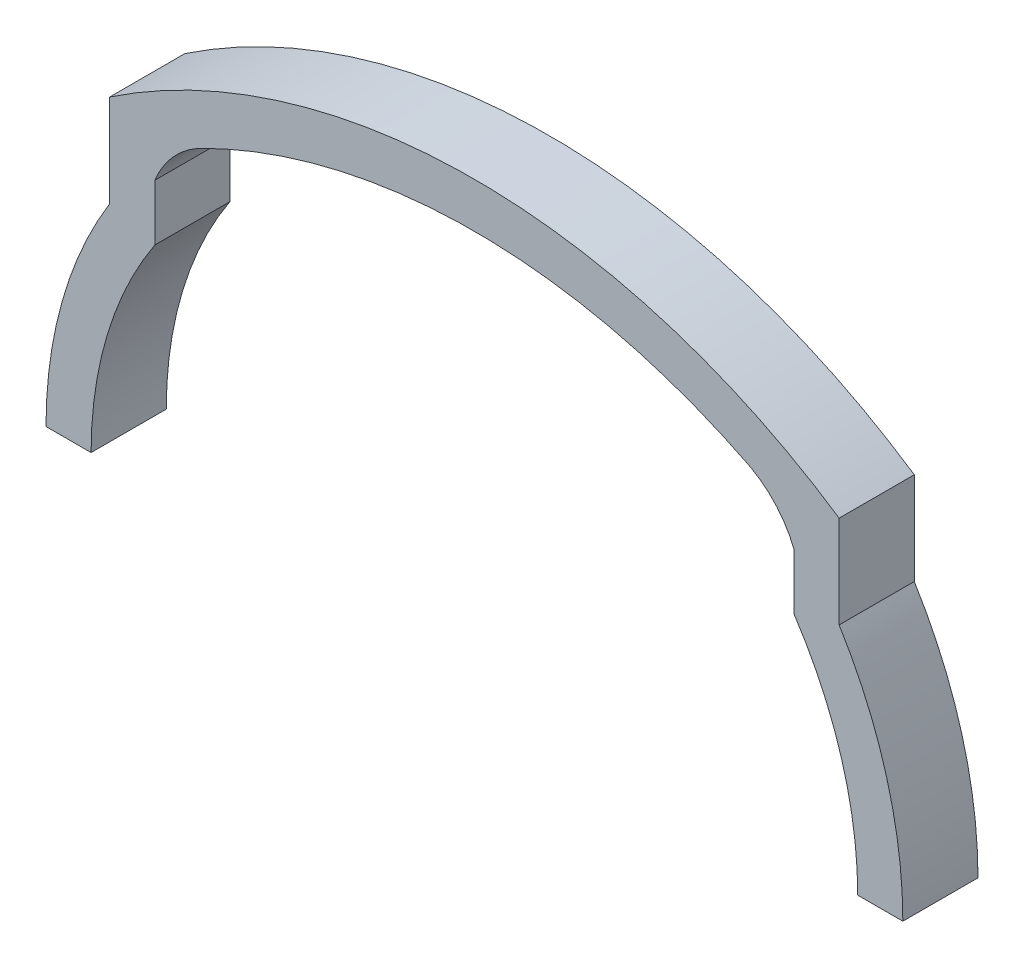
ISO-10303-21;
HEADER;
FILE_DESCRIPTION(('STEP AP214'),'2;1');
FILE_NAME('part.step','',(''),(''),'','','');
FILE_SCHEMA(('AUTOMOTIVE_DESIGN { 1 0 10303 214 1 1 1 1 }'));
ENDSEC;
DATA;
#1=APPLICATION_CONTEXT('core data for automotive mechanical design processes');
#2=APPLICATION_PROTOCOL_DEFINITION('international standard','automotive_design',2000,#1);
#3=PRODUCT_CONTEXT('',#1,'mechanical');
#4=PRODUCT('Part','Part','',(#3));
#5=PRODUCT_RELATED_PRODUCT_CATEGORY('part','',(#4));
#6=PRODUCT_DEFINITION_FORMATION('','',#4);
#7=PRODUCT_DEFINITION_CONTEXT('part definition',#1,'design');
#8=PRODUCT_DEFINITION('design','',#6,#7);
#9=PRODUCT_DEFINITION_SHAPE('','',#8);
#10=(LENGTH_UNIT() NAMED_UNIT(*) SI_UNIT(.MILLI.,.METRE.));
#11=(NAMED_UNIT(*) PLANE_ANGLE_UNIT() SI_UNIT($,.RADIAN.));
#12=(NAMED_UNIT(*) SI_UNIT($,.STERADIAN.) SOLID_ANGLE_UNIT());
#13=UNCERTAINTY_MEASURE_WITH_UNIT(LENGTH_MEASURE(1.E-05),#10,'distance_accuracy_value','');
#14=(GEOMETRIC_REPRESENTATION_CONTEXT(3) GLOBAL_UNCERTAINTY_ASSIGNED_CONTEXT((#13)) GLOBAL_UNIT_ASSIGNED_CONTEXT((#10,
#11,#12)) REPRESENTATION_CONTEXT('',''));
#15=CARTESIAN_POINT('',(0.,0.,0.));
#16=DIRECTION('',(0.,0.,1.));
#17=DIRECTION('',(1.,0.,0.));
#18=AXIS2_PLACEMENT_3D('',#15,#16,#17);
#19=CARTESIAN_POINT('',(15.2226606063706,15.4082945347792,5.));
#20=DIRECTION('',(0.,0.,-1.));
#21=DIRECTION('',(-1.,0.,0.));
#22=AXIS2_PLACEMENT_3D('',#19,#20,#21);
#23=CYLINDRICAL_SURFACE('',#22,6.49856152460727);
#24=CARTESIAN_POINT('',(15.2226606063706,15.4082945347792,0.));
#25=DIRECTION('',(0.,0.,1.));
#26=DIRECTION('',(1.,0.,0.));
#27=AXIS2_PLACEMENT_3D('',#24,#25,#26);
#28=CIRCLE('',#27,6.49856152460727);
#29=CARTESIAN_POINT('',(21.2625,17.8065526502179,0.));
#30=VERTEX_POINT('',#29);
#31=CARTESIAN_POINT('',(18.3614611419998,21.0985698432892,0.));
#32=VERTEX_POINT('',#31);
#33=EDGE_CURVE('E178',#30,#32,#28,.T.);
#34=ORIENTED_EDGE('',*,*,#33,.F.);
#35=DIRECTION('',(0.,0.,-1.));
#36=VECTOR('',#35,1.);
#37=CARTESIAN_POINT('',(21.2625,17.8065526502179,5.));
#38=LINE('',#37,#36);
#39=CARTESIAN_POINT('',(21.2625,17.8065526502179,5.));
#40=VERTEX_POINT('',#39);
#41=EDGE_CURVE('E11',#40,#30,#38,.T.);
#42=ORIENTED_EDGE('',*,*,#41,.F.);
#43=CARTESIAN_POINT('',(15.2226606063706,15.4082945347792,5.));
#44=DIRECTION('',(0.,0.,1.));
#45=DIRECTION('',(1.,0.,0.));
#46=AXIS2_PLACEMENT_3D('',#43,#44,#45);
#47=CIRCLE('',#46,6.49856152460727);
#48=CARTESIAN_POINT('',(18.3614611419998,21.0985698432892,5.));
#49=VERTEX_POINT('',#48);
#50=EDGE_CURVE('E223',#40,#49,#47,.T.);
#51=ORIENTED_EDGE('',*,*,#50,.T.);
#52=DIRECTION('',(0.,0.,-1.));
#53=VECTOR('',#52,1.);
#54=CARTESIAN_POINT('',(18.3614611419998,21.0985698432892,5.));
#55=LINE('',#54,#53);
#56=EDGE_CURVE('E58',#49,#32,#55,.T.);
#57=ORIENTED_EDGE('',*,*,#56,.T.);
#58=EDGE_LOOP('',(#34,#42,#51,#57));
#59=FACE_BOUND('',#58,.T.);
#60=ADVANCED_FACE('F41',(#59),#23,.F.);
#61=CARTESIAN_POINT('',(21.2625,0.,5.));
#62=DIRECTION('',(1.,0.,0.));
#63=DIRECTION('',(0.,1.,0.));
#64=AXIS2_PLACEMENT_3D('',#61,#62,#63);
#65=PLANE('',#64);
#66=DIRECTION('',(0.,-1.,0.));
#67=VECTOR('',#66,1.);
#68=CARTESIAN_POINT('',(21.2625,0.,0.));
#69=LINE('',#68,#67);
#70=CARTESIAN_POINT('',(21.2625,14.0767927366286,0.));
#71=VERTEX_POINT('',#70);
#72=EDGE_CURVE('E181',#30,#71,#69,.T.);
#73=ORIENTED_EDGE('',*,*,#72,.T.);
#74=DIRECTION('',(0.,0.,-1.));
#75=VECTOR('',#74,1.);
#76=CARTESIAN_POINT('',(21.2625,14.0767927366286,5.));
#77=LINE('',#76,#75);
#78=CARTESIAN_POINT('',(21.2625,14.0767927366286,5.));
#79=VERTEX_POINT('',#78);
#80=EDGE_CURVE('E50',#79,#71,#77,.T.);
#81=ORIENTED_EDGE('',*,*,#80,.F.);
#82=DIRECTION('',(0.,-1.,0.));
#83=VECTOR('',#82,1.);
#84=CARTESIAN_POINT('',(21.2625,0.,5.));
#85=LINE('',#84,#83);
#86=EDGE_CURVE('E452',#40,#79,#85,.T.);
#87=ORIENTED_EDGE('',*,*,#86,.F.);
#88=ORIENTED_EDGE('',*,*,#41,.T.);
#89=EDGE_LOOP('',(#73,#81,#87,#88));
#90=FACE_BOUND('',#89,.T.);
#91=ADVANCED_FACE('F267',(#90),#65,.F.);
#92=CARTESIAN_POINT('',(0.,0.,5.));
#93=DIRECTION('',(0.,0.,-1.));
#94=DIRECTION('',(-1.,0.,0.));
#95=AXIS2_PLACEMENT_3D('',#92,#93,#94);
#96=CYLINDRICAL_SURFACE('',#95,25.5);
#97=CARTESIAN_POINT('',(0.,0.,0.));
#98=DIRECTION('',(0.,0.,1.));
#99=DIRECTION('',(1.,0.,0.));
#100=AXIS2_PLACEMENT_3D('',#97,#98,#99);
#101=CIRCLE('',#100,25.5);
#102=CARTESIAN_POINT('',(25.5,0.,0.));
#103=VERTEX_POINT('',#102);
#104=EDGE_CURVE('E185',#103,#71,#101,.T.);
#105=ORIENTED_EDGE('',*,*,#104,.F.);
#106=DIRECTION('',(0.,0.,-1.));
#107=VECTOR('',#106,1.);
#108=CARTESIAN_POINT('',(25.5,0.,5.));
#109=LINE('',#108,#107);
#110=CARTESIAN_POINT('',(25.5,0.,5.));
#111=VERTEX_POINT('',#110);
#112=EDGE_CURVE('E255',#111,#103,#109,.T.);
#113=ORIENTED_EDGE('',*,*,#112,.F.);
#114=CARTESIAN_POINT('',(0.,0.,5.));
#115=DIRECTION('',(0.,0.,1.));
#116=DIRECTION('',(1.,0.,0.));
#117=AXIS2_PLACEMENT_3D('',#114,#115,#116);
#118=CIRCLE('',#117,25.5);
#119=EDGE_CURVE('E264',#111,#79,#118,.T.);
#120=ORIENTED_EDGE('',*,*,#119,.T.);
#121=ORIENTED_EDGE('',*,*,#80,.T.);
#122=EDGE_LOOP('',(#105,#113,#120,#121));
#123=FACE_BOUND('',#122,.T.);
#124=ADVANCED_FACE('F262',(#123),#96,.F.);
#125=CARTESIAN_POINT('',(0.,0.,5.));
#126=DIRECTION('',(0.,1.,0.));
#127=DIRECTION('',(0.,0.,1.));
#128=AXIS2_PLACEMENT_3D('',#125,#126,#127);
#129=PLANE('',#128);
#130=DIRECTION('',(1.,0.,0.));
#131=VECTOR('',#130,1.);
#132=CARTESIAN_POINT('',(0.,0.,0.));
#133=LINE('',#132,#131);
#134=CARTESIAN_POINT('',(28.5,0.,0.));
#135=VERTEX_POINT('',#134);
#136=EDGE_CURVE('E189',#103,#135,#133,.T.);
#137=ORIENTED_EDGE('',*,*,#136,.T.);
#138=DIRECTION('',(0.,0.,-1.));
#139=VECTOR('',#138,1.);
#140=CARTESIAN_POINT('',(28.5,0.,5.));
#141=LINE('',#140,#139);
#142=CARTESIAN_POINT('',(28.5,0.,5.));
#143=VERTEX_POINT('',#142);
#144=EDGE_CURVE('E251',#143,#135,#141,.T.);
#145=ORIENTED_EDGE('',*,*,#144,.F.);
#146=DIRECTION('',(1.,0.,0.));
#147=VECTOR('',#146,1.);
#148=CARTESIAN_POINT('',(0.,0.,5.));
#149=LINE('',#148,#147);
#150=EDGE_CURVE('E285',#111,#143,#149,.T.);
#151=ORIENTED_EDGE('',*,*,#150,.F.);
#152=ORIENTED_EDGE('',*,*,#112,.T.);
#153=EDGE_LOOP('',(#137,#145,#151,#152));
#154=FACE_BOUND('',#153,.T.);
#155=ADVANCED_FACE('F274',(#154),#129,.F.);
#156=CARTESIAN_POINT('',(0.,0.,5.));
#157=DIRECTION('',(0.,0.,-1.));
#158=DIRECTION('',(-1.,0.,0.));
#159=AXIS2_PLACEMENT_3D('',#156,#157,#158);
#160=CYLINDRICAL_SURFACE('',#159,28.5);
#161=CARTESIAN_POINT('',(0.,0.,0.));
#162=DIRECTION('',(0.,0.,1.));
#163=DIRECTION('',(1.,0.,0.));
#164=AXIS2_PLACEMENT_3D('',#161,#162,#163);
#165=CIRCLE('',#164,28.5);
#166=CARTESIAN_POINT('',(24.2625,14.9526283224723,0.));
#167=VERTEX_POINT('',#166);
#168=EDGE_CURVE('E192',#135,#167,#165,.T.);
#169=ORIENTED_EDGE('',*,*,#168,.T.);
#170=DIRECTION('',(0.,0.,-1.));
#171=VECTOR('',#170,1.);
#172=CARTESIAN_POINT('',(24.2625,14.9526283224723,5.));
#173=LINE('',#172,#171);
#174=CARTESIAN_POINT('',(24.2625,14.9526283224723,5.));
#175=VERTEX_POINT('',#174);
#176=EDGE_CURVE('E248',#175,#167,#173,.T.);
#177=ORIENTED_EDGE('',*,*,#176,.F.);
#178=CARTESIAN_POINT('',(0.,0.,5.));
#179=DIRECTION('',(0.,0.,1.));
#180=DIRECTION('',(1.,0.,0.));
#181=AXIS2_PLACEMENT_3D('',#178,#179,#180);
#182=CIRCLE('',#181,28.5);
#183=EDGE_CURVE('E280',#143,#175,#182,.T.);
#184=ORIENTED_EDGE('',*,*,#183,.F.);
#185=ORIENTED_EDGE('',*,*,#144,.T.);
#186=EDGE_LOOP('',(#169,#177,#184,#185));
#187=FACE_BOUND('',#186,.T.);
#188=ADVANCED_FACE('F278',(#187),#160,.T.);
#189=CARTESIAN_POINT('',(24.2625,0.,5.));
#190=DIRECTION('',(1.,0.,0.));
#191=DIRECTION('',(0.,0.,-1.));
#192=AXIS2_PLACEMENT_3D('',#189,#190,#191);
#193=PLANE('',#192);
#194=DIRECTION('',(0.,-1.,0.));
#195=VECTOR('',#194,1.);
#196=CARTESIAN_POINT('',(24.2625,0.,0.));
#197=LINE('',#196,#195);
#198=CARTESIAN_POINT('',(24.2625,21.1051394367893,0.));
#199=VERTEX_POINT('',#198);
#200=EDGE_CURVE('E197',#199,#167,#197,.T.);
#201=ORIENTED_EDGE('',*,*,#200,.F.);
#202=DIRECTION('',(0.,0.,-1.));
#203=VECTOR('',#202,1.);
#204=CARTESIAN_POINT('',(24.2625,21.1051394367893,5.));
#205=LINE('',#204,#203);
#206=CARTESIAN_POINT('',(24.2625,21.1051394367893,5.));
#207=VERTEX_POINT('',#206);
#208=EDGE_CURVE('E245',#207,#199,#205,.T.);
#209=ORIENTED_EDGE('',*,*,#208,.F.);
#210=DIRECTION('',(0.,-1.,0.));
#211=VECTOR('',#210,1.);
#212=CARTESIAN_POINT('',(24.2625,0.,5.));
#213=LINE('',#212,#211);
#214=EDGE_CURVE('E284',#207,#175,#213,.T.);
#215=ORIENTED_EDGE('',*,*,#214,.T.);
#216=ORIENTED_EDGE('',*,*,#176,.T.);
#217=EDGE_LOOP('',(#201,#209,#215,#216));
#218=FACE_BOUND('',#217,.T.);
#219=ADVANCED_FACE('F333',(#218),#193,.T.);
#220=CARTESIAN_POINT('',(0.,-15.,5.));
#221=DIRECTION('',(0.,0.,-1.));
#222=DIRECTION('',(-1.,0.,0.));
#223=AXIS2_PLACEMENT_3D('',#220,#221,#222);
#224=CYLINDRICAL_SURFACE('',#223,43.5);
#225=CARTESIAN_POINT('',(0.,-15.,0.));
#226=DIRECTION('',(0.,0.,1.));
#227=DIRECTION('',(1.,0.,0.));
#228=AXIS2_PLACEMENT_3D('',#225,#226,#227);
#229=CIRCLE('',#228,43.5);
#230=CARTESIAN_POINT('',(-24.2625,21.1051394367893,0.));
#231=VERTEX_POINT('',#230);
#232=EDGE_CURVE('E201',#199,#231,#229,.T.);
#233=ORIENTED_EDGE('',*,*,#232,.T.);
#234=DIRECTION('',(0.,0.,-1.));
#235=VECTOR('',#234,1.);
#236=CARTESIAN_POINT('',(-24.2625,21.1051394367893,5.));
#237=LINE('',#236,#235);
#238=CARTESIAN_POINT('',(-24.2625,21.1051394367893,5.));
#239=VERTEX_POINT('',#238);
#240=EDGE_CURVE('E241',#239,#231,#237,.T.);
#241=ORIENTED_EDGE('',*,*,#240,.F.);
#242=CARTESIAN_POINT('',(0.,-15.,5.));
#243=DIRECTION('',(0.,0.,1.));
#244=DIRECTION('',(1.,0.,0.));
#245=AXIS2_PLACEMENT_3D('',#242,#243,#244);
#246=CIRCLE('',#245,43.5);
#247=EDGE_CURVE('E289',#207,#239,#246,.T.);
#248=ORIENTED_EDGE('',*,*,#247,.F.);
#249=ORIENTED_EDGE('',*,*,#208,.T.);
#250=EDGE_LOOP('',(#233,#241,#248,#249));
#251=FACE_BOUND('',#250,.T.);
#252=ADVANCED_FACE('F336',(#251),#224,.T.);
#253=CARTESIAN_POINT('',(-24.2625,0.,5.));
#254=DIRECTION('',(1.,0.,0.));
#255=DIRECTION('',(0.,0.,-1.));
#256=AXIS2_PLACEMENT_3D('',#253,#254,#255);
#257=PLANE('',#256);
#258=DIRECTION('',(0.,-1.,0.));
#259=VECTOR('',#258,1.);
#260=CARTESIAN_POINT('',(-24.2625,0.,0.));
#261=LINE('',#260,#259);
#262=CARTESIAN_POINT('',(-24.2625,14.9526283224723,0.));
#263=VERTEX_POINT('',#262);
#264=EDGE_CURVE('E204',#231,#263,#261,.T.);
#265=ORIENTED_EDGE('',*,*,#264,.T.);
#266=DIRECTION('',(0.,0.,-1.));
#267=VECTOR('',#266,1.);
#268=CARTESIAN_POINT('',(-24.2625,14.9526283224723,5.));
#269=LINE('',#268,#267);
#270=CARTESIAN_POINT('',(-24.2625,14.9526283224723,5.));
#271=VERTEX_POINT('',#270);
#272=EDGE_CURVE('E237',#271,#263,#269,.T.);
#273=ORIENTED_EDGE('',*,*,#272,.F.);
#274=DIRECTION('',(0.,-1.,0.));
#275=VECTOR('',#274,1.);
#276=CARTESIAN_POINT('',(-24.2625,0.,5.));
#277=LINE('',#276,#275);
#278=EDGE_CURVE('E296',#239,#271,#277,.T.);
#279=ORIENTED_EDGE('',*,*,#278,.F.);
#280=ORIENTED_EDGE('',*,*,#240,.T.);
#281=EDGE_LOOP('',(#265,#273,#279,#280));
#282=FACE_BOUND('',#281,.T.);
#283=ADVANCED_FACE('F340',(#282),#257,.F.);
#284=CARTESIAN_POINT('',(0.,0.,5.));
#285=DIRECTION('',(0.,0.,-1.));
#286=DIRECTION('',(-1.,0.,0.));
#287=AXIS2_PLACEMENT_3D('',#284,#285,#286);
#288=CYLINDRICAL_SURFACE('',#287,28.5);
#289=CARTESIAN_POINT('',(0.,0.,0.));
#290=DIRECTION('',(0.,0.,1.));
#291=DIRECTION('',(1.,0.,0.));
#292=AXIS2_PLACEMENT_3D('',#289,#290,#291);
#293=CIRCLE('',#292,28.5);
#294=CARTESIAN_POINT('',(-28.5,0.,0.));
#295=VERTEX_POINT('',#294);
#296=EDGE_CURVE('E207',#263,#295,#293,.T.);
#297=ORIENTED_EDGE('',*,*,#296,.T.);
#298=DIRECTION('',(0.,0.,-1.));
#299=VECTOR('',#298,1.);
#300=CARTESIAN_POINT('',(-28.5,0.,5.));
#301=LINE('',#300,#299);
#302=CARTESIAN_POINT('',(-28.5,0.,5.));
#303=VERTEX_POINT('',#302);
#304=EDGE_CURVE('E233',#303,#295,#301,.T.);
#305=ORIENTED_EDGE('',*,*,#304,.F.);
#306=CARTESIAN_POINT('',(0.,0.,5.));
#307=DIRECTION('',(0.,0.,1.));
#308=DIRECTION('',(1.,0.,0.));
#309=AXIS2_PLACEMENT_3D('',#306,#307,#308);
#310=CIRCLE('',#309,28.5);
#311=EDGE_CURVE('E298',#271,#303,#310,.T.);
#312=ORIENTED_EDGE('',*,*,#311,.F.);
#313=ORIENTED_EDGE('',*,*,#272,.T.);
#314=EDGE_LOOP('',(#297,#305,#312,#313));
#315=FACE_BOUND('',#314,.T.);
#316=ADVANCED_FACE('F344',(#315),#288,.T.);
#317=CARTESIAN_POINT('',(-25.5,0.,0.));
#318=VERTEX_POINT('',#317);
#319=EDGE_CURVE('E193',#295,#318,#133,.T.);
#320=ORIENTED_EDGE('',*,*,#319,.T.);
#321=DIRECTION('',(0.,0.,-1.));
#322=VECTOR('',#321,1.);
#323=CARTESIAN_POINT('',(-25.5,0.,5.));
#324=LINE('',#323,#322);
#325=CARTESIAN_POINT('',(-25.5,0.,5.));
#326=VERTEX_POINT('',#325);
#327=EDGE_CURVE('E230',#326,#318,#324,.T.);
#328=ORIENTED_EDGE('',*,*,#327,.F.);
#329=EDGE_CURVE('E172',#303,#326,#149,.T.);
#330=ORIENTED_EDGE('',*,*,#329,.F.);
#331=ORIENTED_EDGE('',*,*,#304,.T.);
#332=EDGE_LOOP('',(#320,#328,#330,#331));
#333=FACE_BOUND('',#332,.T.);
#334=ADVANCED_FACE('F307',(#333),#129,.F.);
#335=CARTESIAN_POINT('',(0.,0.,5.));
#336=DIRECTION('',(0.,0.,-1.));
#337=DIRECTION('',(-1.,0.,0.));
#338=AXIS2_PLACEMENT_3D('',#335,#336,#337);
#339=CYLINDRICAL_SURFACE('',#338,25.5);
#340=CARTESIAN_POINT('',(0.,0.,0.));
#341=DIRECTION('',(0.,0.,1.));
#342=DIRECTION('',(1.,0.,0.));
#343=AXIS2_PLACEMENT_3D('',#340,#341,#342);
#344=CIRCLE('',#343,25.5);
#345=CARTESIAN_POINT('',(-21.2625,14.0767927366286,0.));
#346=VERTEX_POINT('',#345);
#347=EDGE_CURVE('E210',#346,#318,#344,.T.);
#348=ORIENTED_EDGE('',*,*,#347,.F.);
#349=DIRECTION('',(0.,0.,-1.));
#350=VECTOR('',#349,1.);
#351=CARTESIAN_POINT('',(-21.2625,14.0767927366286,5.));
#352=LINE('',#351,#350);
#353=CARTESIAN_POINT('',(-21.2625,14.0767927366286,5.));
#354=VERTEX_POINT('',#353);
#355=EDGE_CURVE('E155',#354,#346,#352,.T.);
#356=ORIENTED_EDGE('',*,*,#355,.F.);
#357=CARTESIAN_POINT('',(0.,0.,5.));
#358=DIRECTION('',(0.,0.,1.));
#359=DIRECTION('',(1.,0.,0.));
#360=AXIS2_PLACEMENT_3D('',#357,#358,#359);
#361=CIRCLE('',#360,25.5);
#362=EDGE_CURVE('E168',#354,#326,#361,.T.);
#363=ORIENTED_EDGE('',*,*,#362,.T.);
#364=ORIENTED_EDGE('',*,*,#327,.T.);
#365=EDGE_LOOP('',(#348,#356,#363,#364));
#366=FACE_BOUND('',#365,.T.);
#367=ADVANCED_FACE('F311',(#366),#339,.F.);
#368=CARTESIAN_POINT('',(-21.2625,0.,5.));
#369=DIRECTION('',(1.,0.,0.));
#370=DIRECTION('',(0.,1.,0.));
#371=AXIS2_PLACEMENT_3D('',#368,#369,#370);
#372=PLANE('',#371);
#373=DIRECTION('',(0.,-1.,0.));
#374=VECTOR('',#373,1.);
#375=CARTESIAN_POINT('',(-21.2625,0.,0.));
#376=LINE('',#375,#374);
#377=CARTESIAN_POINT('',(-21.2625,17.8065526502179,0.));
#378=VERTEX_POINT('',#377);
#379=EDGE_CURVE('E151',#378,#346,#376,.T.);
#380=ORIENTED_EDGE('',*,*,#379,.F.);
#381=DIRECTION('',(0.,0.,-1.));
#382=VECTOR('',#381,1.);
#383=CARTESIAN_POINT('',(-21.2625,17.8065526502179,5.));
#384=LINE('',#383,#382);
#385=CARTESIAN_POINT('',(-21.2625,17.8065526502179,5.));
#386=VERTEX_POINT('',#385);
#387=EDGE_CURVE('E145',#386,#378,#384,.T.);
#388=ORIENTED_EDGE('',*,*,#387,.F.);
#389=DIRECTION('',(0.,-1.,0.));
#390=VECTOR('',#389,1.);
#391=CARTESIAN_POINT('',(-21.2625,0.,5.));
#392=LINE('',#391,#390);
#393=EDGE_CURVE('E149',#386,#354,#392,.T.);
#394=ORIENTED_EDGE('',*,*,#393,.T.);
#395=ORIENTED_EDGE('',*,*,#355,.T.);
#396=EDGE_LOOP('',(#380,#388,#394,#395));
#397=FACE_BOUND('',#396,.T.);
#398=ADVANCED_FACE('F147',(#397),#372,.T.);
#399=CARTESIAN_POINT('',(-15.2226606063706,15.4082945347792,5.));
#400=DIRECTION('',(0.,0.,-1.));
#401=DIRECTION('',(-1.,0.,0.));
#402=AXIS2_PLACEMENT_3D('',#399,#400,#401);
#403=CYLINDRICAL_SURFACE('',#402,6.49856152460727);
#404=CARTESIAN_POINT('',(-15.2226606063706,15.4082945347792,0.));
#405=DIRECTION('',(0.,0.,1.));
#406=DIRECTION('',(1.,0.,0.));
#407=AXIS2_PLACEMENT_3D('',#404,#405,#406);
#408=CIRCLE('',#407,6.49856152460727);
#409=CARTESIAN_POINT('',(-18.3614611419998,21.0985698432892,0.));
#410=VERTEX_POINT('',#409);
#411=EDGE_CURVE('E216',#378,#410,#408,.F.);
#412=ORIENTED_EDGE('',*,*,#411,.T.);
#413=DIRECTION('',(0.,0.,-1.));
#414=VECTOR('',#413,1.);
#415=CARTESIAN_POINT('',(-18.3614611419998,21.0985698432892,5.));
#416=LINE('',#415,#414);
#417=CARTESIAN_POINT('',(-18.3614611419998,21.0985698432892,5.));
#418=VERTEX_POINT('',#417);
#419=EDGE_CURVE('E102',#418,#410,#416,.T.);
#420=ORIENTED_EDGE('',*,*,#419,.F.);
#421=CARTESIAN_POINT('',(-15.2226606063706,15.4082945347792,5.));
#422=DIRECTION('',(0.,0.,1.));
#423=DIRECTION('',(1.,0.,0.));
#424=AXIS2_PLACEMENT_3D('',#421,#422,#423);
#425=CIRCLE('',#424,6.49856152460727);
#426=EDGE_CURVE('E157',#386,#418,#425,.F.);
#427=ORIENTED_EDGE('',*,*,#426,.F.);
#428=ORIENTED_EDGE('',*,*,#387,.T.);
#429=EDGE_LOOP('',(#412,#420,#427,#428));
#430=FACE_BOUND('',#429,.T.);
#431=ADVANCED_FACE('F158',(#430),#403,.F.);
#432=CARTESIAN_POINT('',(0.,-15.,5.));
#433=DIRECTION('',(0.,0.,-1.));
#434=DIRECTION('',(-1.,0.,0.));
#435=AXIS2_PLACEMENT_3D('',#432,#433,#434);
#436=CYLINDRICAL_SURFACE('',#435,40.5);
#437=CARTESIAN_POINT('',(0.,-15.,0.));
#438=DIRECTION('',(0.,0.,1.));
#439=DIRECTION('',(1.,0.,0.));
#440=AXIS2_PLACEMENT_3D('',#437,#438,#439);
#441=CIRCLE('',#440,40.5);
#442=EDGE_CURVE('E219',#32,#410,#441,.T.);
#443=ORIENTED_EDGE('',*,*,#442,.F.);
#444=ORIENTED_EDGE('',*,*,#56,.F.);
#445=CARTESIAN_POINT('',(0.,-15.,5.));
#446=DIRECTION('',(0.,0.,1.));
#447=DIRECTION('',(1.,0.,0.));
#448=AXIS2_PLACEMENT_3D('',#445,#446,#447);
#449=CIRCLE('',#448,40.5);
#450=EDGE_CURVE('E162',#49,#418,#449,.T.);
#451=ORIENTED_EDGE('',*,*,#450,.T.);
#452=ORIENTED_EDGE('',*,*,#419,.T.);
#453=EDGE_LOOP('',(#443,#444,#451,#452));
#454=FACE_BOUND('',#453,.T.);
#455=ADVANCED_FACE('F312',(#454),#436,.F.);
#456=CARTESIAN_POINT('',(0.,0.,5.));
#457=DIRECTION('',(0.,0.,1.));
#458=DIRECTION('',(1.,0.,0.));
#459=AXIS2_PLACEMENT_3D('',#456,#457,#458);
#460=PLANE('',#459);
#461=ORIENTED_EDGE('',*,*,#50,.F.);
#462=ORIENTED_EDGE('',*,*,#86,.T.);
#463=ORIENTED_EDGE('',*,*,#119,.F.);
#464=ORIENTED_EDGE('',*,*,#150,.T.);
#465=ORIENTED_EDGE('',*,*,#183,.T.);
#466=ORIENTED_EDGE('',*,*,#214,.F.);
#467=ORIENTED_EDGE('',*,*,#247,.T.);
#468=ORIENTED_EDGE('',*,*,#278,.T.);
#469=ORIENTED_EDGE('',*,*,#311,.T.);
#470=ORIENTED_EDGE('',*,*,#329,.T.);
#471=ORIENTED_EDGE('',*,*,#362,.F.);
#472=ORIENTED_EDGE('',*,*,#393,.F.);
#473=ORIENTED_EDGE('',*,*,#426,.T.);
#474=ORIENTED_EDGE('',*,*,#450,.F.);
#475=EDGE_LOOP('',(#461,#462,#463,#464,#465,#466,#467,#468,#469,#470,#471,#472,#473,#474));
#476=FACE_BOUND('',#475,.T.);
#477=ADVANCED_FACE('F166',(#476),#460,.T.);
#478=CARTESIAN_POINT('',(0.,0.,0.));
#479=DIRECTION('',(0.,0.,1.));
#480=DIRECTION('',(1.,0.,0.));
#481=AXIS2_PLACEMENT_3D('',#478,#479,#480);
#482=PLANE('',#481);
#483=ORIENTED_EDGE('',*,*,#33,.T.);
#484=ORIENTED_EDGE('',*,*,#442,.T.);
#485=ORIENTED_EDGE('',*,*,#411,.F.);
#486=ORIENTED_EDGE('',*,*,#379,.T.);
#487=ORIENTED_EDGE('',*,*,#347,.T.);
#488=ORIENTED_EDGE('',*,*,#319,.F.);
#489=ORIENTED_EDGE('',*,*,#296,.F.);
#490=ORIENTED_EDGE('',*,*,#264,.F.);
#491=ORIENTED_EDGE('',*,*,#232,.F.);
#492=ORIENTED_EDGE('',*,*,#200,.T.);
#493=ORIENTED_EDGE('',*,*,#168,.F.);
#494=ORIENTED_EDGE('',*,*,#136,.F.);
#495=ORIENTED_EDGE('',*,*,#104,.T.);
#496=ORIENTED_EDGE('',*,*,#72,.F.);
#497=EDGE_LOOP('',(#483,#484,#485,#486,#487,#488,#489,#490,#491,#492,#493,#494,#495,#496));
#498=FACE_BOUND('',#497,.T.);
#499=ADVANCED_FACE('F270',(#498),#482,.F.);
#500=CLOSED_SHELL('',(#60,#91,#124,#155,#188,#219,#252,#283,#316,#334,#367,#398,#431,#455,#477,#499));
#501=MANIFOLD_SOLID_BREP('B2',#500);
#502=ADVANCED_BREP_SHAPE_REPRESENTATION('',(#18,#501),#14);
#503=SHAPE_DEFINITION_REPRESENTATION(#9,#502);
ENDSEC;
END-ISO-10303-21;
